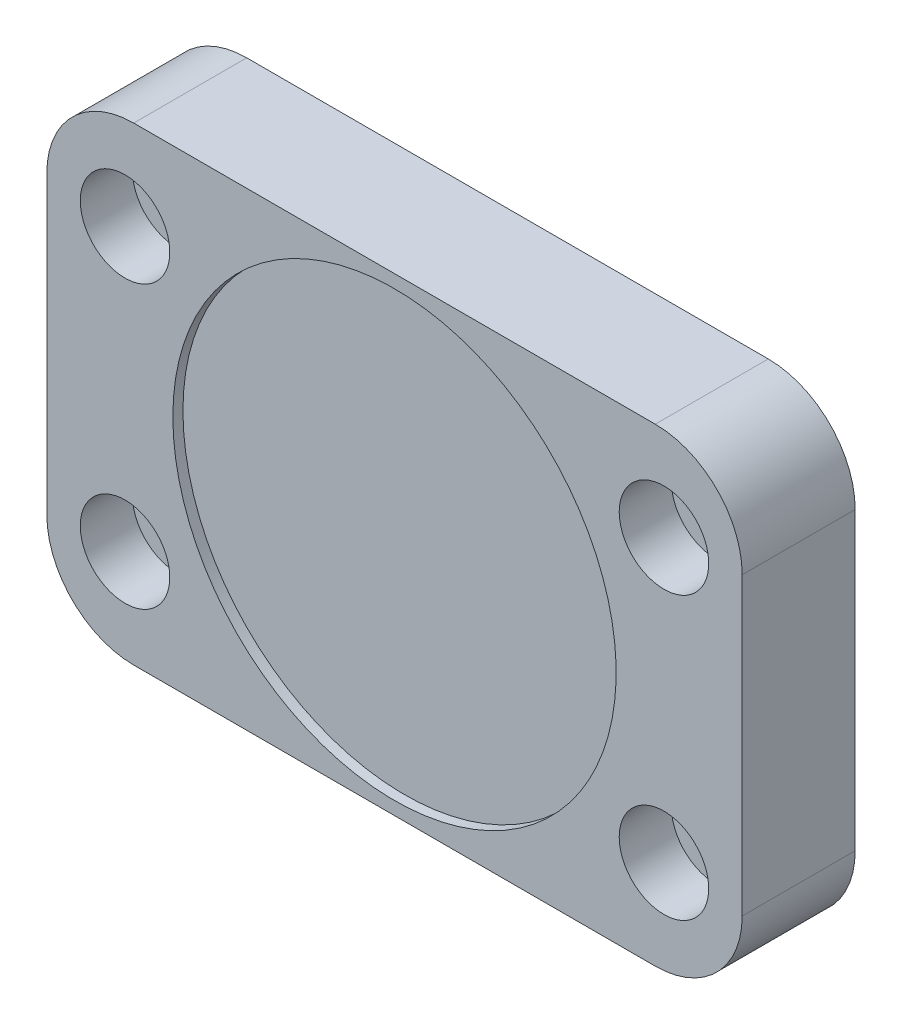
ISO-10303-21;
HEADER;
FILE_DESCRIPTION(('STEP AP214'),'2;1');
FILE_NAME('part.step','',(''),(''),'','','');
FILE_SCHEMA(('AUTOMOTIVE_DESIGN { 1 0 10303 214 1 1 1 1 }'));
ENDSEC;
DATA;
#1=APPLICATION_CONTEXT('core data for automotive mechanical design processes');
#2=APPLICATION_PROTOCOL_DEFINITION('international standard','automotive_design',2000,#1);
#3=PRODUCT_CONTEXT('',#1,'mechanical');
#4=PRODUCT('Part','Part','',(#3));
#5=PRODUCT_RELATED_PRODUCT_CATEGORY('part','',(#4));
#6=PRODUCT_DEFINITION_FORMATION('','',#4);
#7=PRODUCT_DEFINITION_CONTEXT('part definition',#1,'design');
#8=PRODUCT_DEFINITION('design','',#6,#7);
#9=PRODUCT_DEFINITION_SHAPE('','',#8);
#10=(LENGTH_UNIT() NAMED_UNIT(*) SI_UNIT(.MILLI.,.METRE.));
#11=(NAMED_UNIT(*) PLANE_ANGLE_UNIT() SI_UNIT($,.RADIAN.));
#12=(NAMED_UNIT(*) SI_UNIT($,.STERADIAN.) SOLID_ANGLE_UNIT());
#13=UNCERTAINTY_MEASURE_WITH_UNIT(LENGTH_MEASURE(1.E-05),#10,'distance_accuracy_value','');
#14=(GEOMETRIC_REPRESENTATION_CONTEXT(3) GLOBAL_UNCERTAINTY_ASSIGNED_CONTEXT((#13)) GLOBAL_UNIT_ASSIGNED_CONTEXT((#10,
#11,#12)) REPRESENTATION_CONTEXT('',''));
#15=CARTESIAN_POINT('',(0.,0.,0.));
#16=DIRECTION('',(0.,0.,1.));
#17=DIRECTION('',(1.,0.,0.));
#18=AXIS2_PLACEMENT_3D('',#15,#16,#17);
#19=CARTESIAN_POINT('',(0.,189.,37.84));
#20=DIRECTION('',(0.,0.,1.));
#21=DIRECTION('',(1.,0.,0.));
#22=AXIS2_PLACEMENT_3D('',#19,#20,#21);
#23=PLANE('',#22);
#24=CARTESIAN_POINT('',(0.,189.,37.84));
#25=DIRECTION('',(0.,0.,-1.));
#26=DIRECTION('',(-1.,0.,0.));
#27=AXIS2_PLACEMENT_3D('',#24,#25,#26);
#28=CIRCLE('',#27,25.5);
#29=CARTESIAN_POINT('',(-25.5,189.,37.84));
#30=VERTEX_POINT('',#29);
#31=EDGE_CURVE('E19',#30,#30,#28,.F.);
#32=ORIENTED_EDGE('',*,*,#31,.T.);
#33=EDGE_LOOP('',(#32));
#34=FACE_BOUND('',#33,.T.);
#35=ADVANCED_FACE('F16',(#34),#23,.T.);
#36=CARTESIAN_POINT('',(0.,189.,39.));
#37=DIRECTION('',(0.,0.,-1.));
#38=DIRECTION('',(-1.,0.,0.));
#39=AXIS2_PLACEMENT_3D('',#36,#37,#38);
#40=CYLINDRICAL_SURFACE('',#39,25.5);
#41=ORIENTED_EDGE('',*,*,#31,.F.);
#42=EDGE_LOOP('',(#41));
#43=FACE_BOUND('',#42,.T.);
#44=CARTESIAN_POINT('',(0.,189.,39.));
#45=DIRECTION('',(0.,0.,-1.));
#46=DIRECTION('',(-1.,0.,0.));
#47=AXIS2_PLACEMENT_3D('',#44,#45,#46);
#48=CIRCLE('',#47,25.5);
#49=CARTESIAN_POINT('',(-25.5,189.,39.));
#50=VERTEX_POINT('',#49);
#51=EDGE_CURVE('E170',#50,#50,#48,.T.);
#52=ORIENTED_EDGE('',*,*,#51,.F.);
#53=EDGE_LOOP('',(#52));
#54=FACE_BOUND('',#53,.T.);
#55=ADVANCED_FACE('F189',(#43,#54),#40,.F.);
#56=CARTESIAN_POINT('',(30.9999999999999,172.8,36.));
#57=DIRECTION('',(0.,0.,-1.));
#58=DIRECTION('',(-1.,0.,0.));
#59=AXIS2_PLACEMENT_3D('',#56,#57,#58);
#60=CYLINDRICAL_SURFACE('',#59,5.15);
#61=CARTESIAN_POINT('',(30.9999999999999,172.8,33.));
#62=DIRECTION('',(0.,0.,-1.));
#63=DIRECTION('',(-1.,0.,0.));
#64=AXIS2_PLACEMENT_3D('',#61,#62,#63);
#65=CIRCLE('',#64,5.15);
#66=CARTESIAN_POINT('',(25.8499999999999,172.8,33.));
#67=VERTEX_POINT('',#66);
#68=EDGE_CURVE('E167',#67,#67,#65,.T.);
#69=ORIENTED_EDGE('',*,*,#68,.T.);
#70=EDGE_LOOP('',(#69));
#71=FACE_BOUND('',#70,.T.);
#72=CARTESIAN_POINT('',(30.9999999999999,172.8,39.));
#73=DIRECTION('',(0.,0.,-1.));
#74=DIRECTION('',(-1.,0.,0.));
#75=AXIS2_PLACEMENT_3D('',#72,#73,#74);
#76=CIRCLE('',#75,5.15);
#77=CARTESIAN_POINT('',(25.8499999999999,172.8,39.));
#78=VERTEX_POINT('',#77);
#79=EDGE_CURVE('E181',#78,#78,#76,.T.);
#80=ORIENTED_EDGE('',*,*,#79,.F.);
#81=EDGE_LOOP('',(#80));
#82=FACE_BOUND('',#81,.T.);
#83=ADVANCED_FACE('F192',(#71,#82),#60,.F.);
#84=CARTESIAN_POINT('',(-31.0000000000002,205.2,36.));
#85=DIRECTION('',(0.,0.,-1.));
#86=DIRECTION('',(-1.,0.,0.));
#87=AXIS2_PLACEMENT_3D('',#84,#85,#86);
#88=CYLINDRICAL_SURFACE('',#87,5.15);
#89=CARTESIAN_POINT('',(-31.0000000000002,205.2,33.));
#90=DIRECTION('',(0.,0.,-1.));
#91=DIRECTION('',(-1.,0.,0.));
#92=AXIS2_PLACEMENT_3D('',#89,#90,#91);
#93=CIRCLE('',#92,5.15);
#94=CARTESIAN_POINT('',(-36.1500000000002,205.2,33.));
#95=VERTEX_POINT('',#94);
#96=EDGE_CURVE('E164',#95,#95,#93,.T.);
#97=ORIENTED_EDGE('',*,*,#96,.T.);
#98=EDGE_LOOP('',(#97));
#99=FACE_BOUND('',#98,.T.);
#100=CARTESIAN_POINT('',(-31.0000000000002,205.2,39.));
#101=DIRECTION('',(0.,0.,-1.));
#102=DIRECTION('',(-1.,0.,0.));
#103=AXIS2_PLACEMENT_3D('',#100,#101,#102);
#104=CIRCLE('',#103,5.15);
#105=CARTESIAN_POINT('',(-36.1500000000002,205.2,39.));
#106=VERTEX_POINT('',#105);
#107=EDGE_CURVE('E179',#106,#106,#104,.T.);
#108=ORIENTED_EDGE('',*,*,#107,.F.);
#109=EDGE_LOOP('',(#108));
#110=FACE_BOUND('',#109,.T.);
#111=ADVANCED_FACE('F206',(#99,#110),#88,.F.);
#112=CARTESIAN_POINT('',(-31.0000000000001,172.8,36.));
#113=DIRECTION('',(0.,0.,-1.));
#114=DIRECTION('',(-1.,0.,0.));
#115=AXIS2_PLACEMENT_3D('',#112,#113,#114);
#116=CYLINDRICAL_SURFACE('',#115,5.15);
#117=CARTESIAN_POINT('',(-31.0000000000001,172.8,33.));
#118=DIRECTION('',(0.,0.,-1.));
#119=DIRECTION('',(-1.,0.,0.));
#120=AXIS2_PLACEMENT_3D('',#117,#118,#119);
#121=CIRCLE('',#120,5.15);
#122=CARTESIAN_POINT('',(-36.1500000000001,172.8,33.));
#123=VERTEX_POINT('',#122);
#124=EDGE_CURVE('E161',#123,#123,#121,.T.);
#125=ORIENTED_EDGE('',*,*,#124,.T.);
#126=EDGE_LOOP('',(#125));
#127=FACE_BOUND('',#126,.T.);
#128=CARTESIAN_POINT('',(-31.0000000000001,172.8,39.));
#129=DIRECTION('',(0.,0.,-1.));
#130=DIRECTION('',(-1.,0.,0.));
#131=AXIS2_PLACEMENT_3D('',#128,#129,#130);
#132=CIRCLE('',#131,5.15);
#133=CARTESIAN_POINT('',(-36.1500000000001,172.8,39.));
#134=VERTEX_POINT('',#133);
#135=EDGE_CURVE('E176',#134,#134,#132,.T.);
#136=ORIENTED_EDGE('',*,*,#135,.F.);
#137=EDGE_LOOP('',(#136));
#138=FACE_BOUND('',#137,.T.);
#139=ADVANCED_FACE('F208',(#127,#138),#116,.F.);
#140=CARTESIAN_POINT('',(30.9999999999998,205.2,36.));
#141=DIRECTION('',(0.,0.,-1.));
#142=DIRECTION('',(-1.,0.,0.));
#143=AXIS2_PLACEMENT_3D('',#140,#141,#142);
#144=CYLINDRICAL_SURFACE('',#143,5.15);
#145=CARTESIAN_POINT('',(30.9999999999998,205.2,33.));
#146=DIRECTION('',(0.,0.,-1.));
#147=DIRECTION('',(-1.,0.,0.));
#148=AXIS2_PLACEMENT_3D('',#145,#146,#147);
#149=CIRCLE('',#148,5.15);
#150=CARTESIAN_POINT('',(25.8499999999998,205.2,33.));
#151=VERTEX_POINT('',#150);
#152=EDGE_CURVE('E102',#151,#151,#149,.T.);
#153=ORIENTED_EDGE('',*,*,#152,.T.);
#154=EDGE_LOOP('',(#153));
#155=FACE_BOUND('',#154,.T.);
#156=CARTESIAN_POINT('',(30.9999999999998,205.2,39.));
#157=DIRECTION('',(0.,0.,-1.));
#158=DIRECTION('',(-1.,0.,0.));
#159=AXIS2_PLACEMENT_3D('',#156,#157,#158);
#160=CIRCLE('',#159,5.15);
#161=CARTESIAN_POINT('',(25.8499999999998,205.2,39.));
#162=VERTEX_POINT('',#161);
#163=EDGE_CURVE('E173',#162,#162,#160,.T.);
#164=ORIENTED_EDGE('',*,*,#163,.F.);
#165=EDGE_LOOP('',(#164));
#166=FACE_BOUND('',#165,.T.);
#167=ADVANCED_FACE('F198',(#155,#166),#144,.F.);
#168=CARTESIAN_POINT('',(0.,189.,39.));
#169=DIRECTION('',(0.,0.,1.));
#170=DIRECTION('',(1.,0.,0.));
#171=AXIS2_PLACEMENT_3D('',#168,#169,#170);
#172=PLANE('',#171);
#173=ORIENTED_EDGE('',*,*,#51,.T.);
#174=EDGE_LOOP('',(#173));
#175=FACE_BOUND('',#174,.T.);
#176=ORIENTED_EDGE('',*,*,#163,.T.);
#177=EDGE_LOOP('',(#176));
#178=FACE_BOUND('',#177,.T.);
#179=ORIENTED_EDGE('',*,*,#135,.T.);
#180=EDGE_LOOP('',(#179));
#181=FACE_BOUND('',#180,.T.);
#182=ORIENTED_EDGE('',*,*,#107,.T.);
#183=EDGE_LOOP('',(#182));
#184=FACE_BOUND('',#183,.T.);
#185=ORIENTED_EDGE('',*,*,#79,.T.);
#186=EDGE_LOOP('',(#185));
#187=FACE_BOUND('',#186,.T.);
#188=CARTESIAN_POINT('',(30.0000000000002,206.,39.));
#189=DIRECTION('',(0.,0.,1.));
#190=DIRECTION('',(1.,0.,0.));
#191=AXIS2_PLACEMENT_3D('',#188,#189,#190);
#192=CIRCLE('',#191,10.);
#193=CARTESIAN_POINT('',(30.0000000000002,216.,39.));
#194=VERTEX_POINT('',#193);
#195=CARTESIAN_POINT('',(40.0000000000002,206.,39.));
#196=VERTEX_POINT('',#195);
#197=EDGE_CURVE('E155',#194,#196,#192,.F.);
#198=ORIENTED_EDGE('',*,*,#197,.F.);
#199=DIRECTION('',(1.,0.,0.));
#200=VECTOR('',#199,1.);
#201=CARTESIAN_POINT('',(30.0000000000002,216.,39.));
#202=LINE('',#201,#200);
#203=CARTESIAN_POINT('',(-30.0000000000002,216.,39.));
#204=VERTEX_POINT('',#203);
#205=EDGE_CURVE('E112',#204,#194,#202,.T.);
#206=ORIENTED_EDGE('',*,*,#205,.F.);
#207=CARTESIAN_POINT('',(-30.0000000000002,206.,39.));
#208=DIRECTION('',(0.,0.,1.));
#209=DIRECTION('',(1.,0.,0.));
#210=AXIS2_PLACEMENT_3D('',#207,#208,#209);
#211=CIRCLE('',#210,10.);
#212=CARTESIAN_POINT('',(-40.0000000000002,206.,39.));
#213=VERTEX_POINT('',#212);
#214=EDGE_CURVE('E98',#213,#204,#211,.F.);
#215=ORIENTED_EDGE('',*,*,#214,.F.);
#216=DIRECTION('',(0.,1.,0.));
#217=VECTOR('',#216,1.);
#218=CARTESIAN_POINT('',(-40.0000000000002,206.,39.));
#219=LINE('',#218,#217);
#220=CARTESIAN_POINT('',(-40.0000000000002,172.,39.));
#221=VERTEX_POINT('',#220);
#222=EDGE_CURVE('E92',#221,#213,#219,.T.);
#223=ORIENTED_EDGE('',*,*,#222,.F.);
#224=CARTESIAN_POINT('',(-30.0000000000002,172.,39.));
#225=DIRECTION('',(0.,0.,1.));
#226=DIRECTION('',(1.,0.,0.));
#227=AXIS2_PLACEMENT_3D('',#224,#225,#226);
#228=CIRCLE('',#227,10.);
#229=CARTESIAN_POINT('',(-30.0000000000002,162.,39.));
#230=VERTEX_POINT('',#229);
#231=EDGE_CURVE('E83',#230,#221,#228,.F.);
#232=ORIENTED_EDGE('',*,*,#231,.F.);
#233=DIRECTION('',(1.,0.,0.));
#234=VECTOR('',#233,1.);
#235=CARTESIAN_POINT('',(-30.0000000000002,162.,39.));
#236=LINE('',#235,#234);
#237=CARTESIAN_POINT('',(30.0000000000002,162.,39.));
#238=VERTEX_POINT('',#237);
#239=EDGE_CURVE('E78',#238,#230,#236,.F.);
#240=ORIENTED_EDGE('',*,*,#239,.F.);
#241=CARTESIAN_POINT('',(30.0000000000002,172.,39.));
#242=DIRECTION('',(0.,0.,1.));
#243=DIRECTION('',(1.,0.,0.));
#244=AXIS2_PLACEMENT_3D('',#241,#242,#243);
#245=CIRCLE('',#244,10.);
#246=CARTESIAN_POINT('',(40.0000000000002,172.,39.));
#247=VERTEX_POINT('',#246);
#248=EDGE_CURVE('E157',#247,#238,#245,.F.);
#249=ORIENTED_EDGE('',*,*,#248,.F.);
#250=DIRECTION('',(0.,1.,0.));
#251=VECTOR('',#250,1.);
#252=CARTESIAN_POINT('',(40.0000000000002,172.,39.));
#253=LINE('',#252,#251);
#254=EDGE_CURVE('E116',#196,#247,#253,.F.);
#255=ORIENTED_EDGE('',*,*,#254,.F.);
#256=EDGE_LOOP('',(#198,#206,#215,#223,#232,#240,#249,#255));
#257=FACE_BOUND('',#256,.T.);
#258=ADVANCED_FACE('F96',(#175,#178,#181,#184,#187,#257),#172,.T.);
#259=CARTESIAN_POINT('',(30.9999999999999,172.8,33.));
#260=DIRECTION('',(0.,0.,-1.));
#261=DIRECTION('',(-1.,0.,0.));
#262=AXIS2_PLACEMENT_3D('',#259,#260,#261);
#263=PLANE('',#262);
#264=CARTESIAN_POINT('',(30.9999999999999,172.8,33.));
#265=DIRECTION('',(0.,0.,-1.));
#266=DIRECTION('',(-1.,0.,0.));
#267=AXIS2_PLACEMENT_3D('',#264,#265,#266);
#268=CIRCLE('',#267,3.075);
#269=CARTESIAN_POINT('',(27.9249999999999,172.8,33.));
#270=VERTEX_POINT('',#269);
#271=EDGE_CURVE('E150',#270,#270,#268,.T.);
#272=ORIENTED_EDGE('',*,*,#271,.T.);
#273=EDGE_LOOP('',(#272));
#274=FACE_BOUND('',#273,.T.);
#275=ORIENTED_EDGE('',*,*,#68,.F.);
#276=EDGE_LOOP('',(#275));
#277=FACE_BOUND('',#276,.T.);
#278=ADVANCED_FACE('F197',(#274,#277),#263,.F.);
#279=CARTESIAN_POINT('',(-31.0000000000002,205.2,33.));
#280=DIRECTION('',(0.,0.,-1.));
#281=DIRECTION('',(-1.,0.,0.));
#282=AXIS2_PLACEMENT_3D('',#279,#280,#281);
#283=PLANE('',#282);
#284=CARTESIAN_POINT('',(-31.0000000000002,205.2,33.));
#285=DIRECTION('',(0.,0.,-1.));
#286=DIRECTION('',(-1.,0.,0.));
#287=AXIS2_PLACEMENT_3D('',#284,#285,#286);
#288=CIRCLE('',#287,3.075);
#289=CARTESIAN_POINT('',(-34.0750000000002,205.2,33.));
#290=VERTEX_POINT('',#289);
#291=EDGE_CURVE('E147',#290,#290,#288,.T.);
#292=ORIENTED_EDGE('',*,*,#291,.T.);
#293=EDGE_LOOP('',(#292));
#294=FACE_BOUND('',#293,.T.);
#295=ORIENTED_EDGE('',*,*,#96,.F.);
#296=EDGE_LOOP('',(#295));
#297=FACE_BOUND('',#296,.T.);
#298=ADVANCED_FACE('F278',(#294,#297),#283,.F.);
#299=CARTESIAN_POINT('',(-31.0000000000001,172.8,33.));
#300=DIRECTION('',(0.,0.,-1.));
#301=DIRECTION('',(-1.,0.,0.));
#302=AXIS2_PLACEMENT_3D('',#299,#300,#301);
#303=PLANE('',#302);
#304=CARTESIAN_POINT('',(-31.0000000000001,172.8,33.));
#305=DIRECTION('',(0.,0.,-1.));
#306=DIRECTION('',(-1.,0.,0.));
#307=AXIS2_PLACEMENT_3D('',#304,#305,#306);
#308=CIRCLE('',#307,3.075);
#309=CARTESIAN_POINT('',(-34.0750000000001,172.8,33.));
#310=VERTEX_POINT('',#309);
#311=EDGE_CURVE('E144',#310,#310,#308,.T.);
#312=ORIENTED_EDGE('',*,*,#311,.T.);
#313=EDGE_LOOP('',(#312));
#314=FACE_BOUND('',#313,.T.);
#315=ORIENTED_EDGE('',*,*,#124,.F.);
#316=EDGE_LOOP('',(#315));
#317=FACE_BOUND('',#316,.T.);
#318=ADVANCED_FACE('F274',(#314,#317),#303,.F.);
#319=CARTESIAN_POINT('',(30.9999999999998,205.2,33.));
#320=DIRECTION('',(0.,0.,-1.));
#321=DIRECTION('',(-1.,0.,0.));
#322=AXIS2_PLACEMENT_3D('',#319,#320,#321);
#323=PLANE('',#322);
#324=CARTESIAN_POINT('',(30.9999999999998,205.2,33.));
#325=DIRECTION('',(0.,0.,-1.));
#326=DIRECTION('',(-1.,0.,0.));
#327=AXIS2_PLACEMENT_3D('',#324,#325,#326);
#328=CIRCLE('',#327,3.075);
#329=CARTESIAN_POINT('',(27.9249999999998,205.2,33.));
#330=VERTEX_POINT('',#329);
#331=EDGE_CURVE('E141',#330,#330,#328,.T.);
#332=ORIENTED_EDGE('',*,*,#331,.T.);
#333=EDGE_LOOP('',(#332));
#334=FACE_BOUND('',#333,.T.);
#335=ORIENTED_EDGE('',*,*,#152,.F.);
#336=EDGE_LOOP('',(#335));
#337=FACE_BOUND('',#336,.T.);
#338=ADVANCED_FACE('F271',(#334,#337),#323,.F.);
#339=CARTESIAN_POINT('',(-40.0000000000002,206.,26.));
#340=DIRECTION('',(-1.,0.,0.));
#341=DIRECTION('',(0.,0.,1.));
#342=AXIS2_PLACEMENT_3D('',#339,#340,#341);
#343=PLANE('',#342);
#344=ORIENTED_EDGE('',*,*,#222,.T.);
#345=DIRECTION('',(0.,0.,1.));
#346=VECTOR('',#345,1.);
#347=CARTESIAN_POINT('',(-40.0000000000002,206.,26.));
#348=LINE('',#347,#346);
#349=CARTESIAN_POINT('',(-40.0000000000002,206.,26.));
#350=VERTEX_POINT('',#349);
#351=EDGE_CURVE('E154',#350,#213,#348,.T.);
#352=ORIENTED_EDGE('',*,*,#351,.F.);
#353=DIRECTION('',(0.,1.,0.));
#354=VECTOR('',#353,1.);
#355=CARTESIAN_POINT('',(-40.0000000000002,189.,26.));
#356=LINE('',#355,#354);
#357=CARTESIAN_POINT('',(-40.0000000000002,172.,26.));
#358=VERTEX_POINT('',#357);
#359=EDGE_CURVE('E106',#350,#358,#356,.F.);
#360=ORIENTED_EDGE('',*,*,#359,.T.);
#361=DIRECTION('',(0.,0.,1.));
#362=VECTOR('',#361,1.);
#363=CARTESIAN_POINT('',(-40.0000000000002,172.,26.));
#364=LINE('',#363,#362);
#365=EDGE_CURVE('E88',#221,#358,#364,.F.);
#366=ORIENTED_EDGE('',*,*,#365,.F.);
#367=EDGE_LOOP('',(#344,#352,#360,#366));
#368=FACE_BOUND('',#367,.T.);
#369=ADVANCED_FACE('F105',(#368),#343,.T.);
#370=CARTESIAN_POINT('',(-30.0000000000002,172.,26.));
#371=DIRECTION('',(0.,0.,1.));
#372=DIRECTION('',(1.,0.,0.));
#373=AXIS2_PLACEMENT_3D('',#370,#371,#372);
#374=CYLINDRICAL_SURFACE('',#373,10.);
#375=ORIENTED_EDGE('',*,*,#231,.T.);
#376=ORIENTED_EDGE('',*,*,#365,.T.);
#377=CARTESIAN_POINT('',(-30.0000000000002,172.,26.));
#378=DIRECTION('',(0.,0.,1.));
#379=DIRECTION('',(1.,0.,0.));
#380=AXIS2_PLACEMENT_3D('',#377,#378,#379);
#381=CIRCLE('',#380,10.);
#382=CARTESIAN_POINT('',(-30.0000000000002,162.,26.));
#383=VERTEX_POINT('',#382);
#384=EDGE_CURVE('E139',#358,#383,#381,.T.);
#385=ORIENTED_EDGE('',*,*,#384,.T.);
#386=DIRECTION('',(0.,0.,-1.));
#387=VECTOR('',#386,1.);
#388=CARTESIAN_POINT('',(-30.0000000000002,162.,26.));
#389=LINE('',#388,#387);
#390=EDGE_CURVE('E90',#230,#383,#389,.T.);
#391=ORIENTED_EDGE('',*,*,#390,.F.);
#392=EDGE_LOOP('',(#375,#376,#385,#391));
#393=FACE_BOUND('',#392,.T.);
#394=ADVANCED_FACE('F85',(#393),#374,.T.);
#395=CARTESIAN_POINT('',(-30.0000000000002,162.,26.));
#396=DIRECTION('',(0.,-1.,0.));
#397=DIRECTION('',(0.,0.,-1.));
#398=AXIS2_PLACEMENT_3D('',#395,#396,#397);
#399=PLANE('',#398);
#400=ORIENTED_EDGE('',*,*,#239,.T.);
#401=ORIENTED_EDGE('',*,*,#390,.T.);
#402=DIRECTION('',(1.,0.,0.));
#403=VECTOR('',#402,1.);
#404=CARTESIAN_POINT('',(0.,162.,26.));
#405=LINE('',#404,#403);
#406=CARTESIAN_POINT('',(30.0000000000002,162.,26.));
#407=VERTEX_POINT('',#406);
#408=EDGE_CURVE('E138',#383,#407,#405,.T.);
#409=ORIENTED_EDGE('',*,*,#408,.T.);
#410=DIRECTION('',(0.,0.,1.));
#411=VECTOR('',#410,1.);
#412=CARTESIAN_POINT('',(30.0000000000002,162.,26.));
#413=LINE('',#412,#411);
#414=EDGE_CURVE('E118',#238,#407,#413,.F.);
#415=ORIENTED_EDGE('',*,*,#414,.F.);
#416=EDGE_LOOP('',(#400,#401,#409,#415));
#417=FACE_BOUND('',#416,.T.);
#418=ADVANCED_FACE('F263',(#417),#399,.T.);
#419=CARTESIAN_POINT('',(30.0000000000002,172.,26.));
#420=DIRECTION('',(0.,0.,1.));
#421=DIRECTION('',(1.,0.,0.));
#422=AXIS2_PLACEMENT_3D('',#419,#420,#421);
#423=CYLINDRICAL_SURFACE('',#422,10.);
#424=ORIENTED_EDGE('',*,*,#248,.T.);
#425=ORIENTED_EDGE('',*,*,#414,.T.);
#426=CARTESIAN_POINT('',(30.0000000000002,172.,26.));
#427=DIRECTION('',(0.,0.,1.));
#428=DIRECTION('',(1.,0.,0.));
#429=AXIS2_PLACEMENT_3D('',#426,#427,#428);
#430=CIRCLE('',#429,10.);
#431=CARTESIAN_POINT('',(40.0000000000002,172.,26.));
#432=VERTEX_POINT('',#431);
#433=EDGE_CURVE('E135',#407,#432,#430,.T.);
#434=ORIENTED_EDGE('',*,*,#433,.T.);
#435=DIRECTION('',(0.,0.,-1.));
#436=VECTOR('',#435,1.);
#437=CARTESIAN_POINT('',(40.0000000000002,172.,26.));
#438=LINE('',#437,#436);
#439=EDGE_CURVE('E117',#247,#432,#438,.T.);
#440=ORIENTED_EDGE('',*,*,#439,.F.);
#441=EDGE_LOOP('',(#424,#425,#434,#440));
#442=FACE_BOUND('',#441,.T.);
#443=ADVANCED_FACE('F259',(#442),#423,.T.);
#444=CARTESIAN_POINT('',(40.0000000000002,172.,26.));
#445=DIRECTION('',(1.,0.,0.));
#446=DIRECTION('',(0.,0.,-1.));
#447=AXIS2_PLACEMENT_3D('',#444,#445,#446);
#448=PLANE('',#447);
#449=ORIENTED_EDGE('',*,*,#254,.T.);
#450=ORIENTED_EDGE('',*,*,#439,.T.);
#451=DIRECTION('',(0.,1.,0.));
#452=VECTOR('',#451,1.);
#453=CARTESIAN_POINT('',(40.0000000000002,189.,26.));
#454=LINE('',#453,#452);
#455=CARTESIAN_POINT('',(40.0000000000002,206.,26.));
#456=VERTEX_POINT('',#455);
#457=EDGE_CURVE('E134',#432,#456,#454,.T.);
#458=ORIENTED_EDGE('',*,*,#457,.T.);
#459=DIRECTION('',(0.,0.,1.));
#460=VECTOR('',#459,1.);
#461=CARTESIAN_POINT('',(40.0000000000002,206.,26.));
#462=LINE('',#461,#460);
#463=EDGE_CURVE('E114',#196,#456,#462,.F.);
#464=ORIENTED_EDGE('',*,*,#463,.F.);
#465=EDGE_LOOP('',(#449,#450,#458,#464));
#466=FACE_BOUND('',#465,.T.);
#467=ADVANCED_FACE('F255',(#466),#448,.T.);
#468=CARTESIAN_POINT('',(30.0000000000002,206.,26.));
#469=DIRECTION('',(0.,0.,1.));
#470=DIRECTION('',(1.,0.,0.));
#471=AXIS2_PLACEMENT_3D('',#468,#469,#470);
#472=CYLINDRICAL_SURFACE('',#471,10.);
#473=ORIENTED_EDGE('',*,*,#197,.T.);
#474=ORIENTED_EDGE('',*,*,#463,.T.);
#475=CARTESIAN_POINT('',(30.0000000000002,206.,26.));
#476=DIRECTION('',(0.,0.,1.));
#477=DIRECTION('',(1.,0.,0.));
#478=AXIS2_PLACEMENT_3D('',#475,#476,#477);
#479=CIRCLE('',#478,10.);
#480=CARTESIAN_POINT('',(30.0000000000002,216.,26.));
#481=VERTEX_POINT('',#480);
#482=EDGE_CURVE('E131',#456,#481,#479,.T.);
#483=ORIENTED_EDGE('',*,*,#482,.T.);
#484=DIRECTION('',(0.,0.,1.));
#485=VECTOR('',#484,1.);
#486=CARTESIAN_POINT('',(30.0000000000002,216.,26.));
#487=LINE('',#486,#485);
#488=EDGE_CURVE('E113',#194,#481,#487,.F.);
#489=ORIENTED_EDGE('',*,*,#488,.F.);
#490=EDGE_LOOP('',(#473,#474,#483,#489));
#491=FACE_BOUND('',#490,.T.);
#492=ADVANCED_FACE('F251',(#491),#472,.T.);
#493=CARTESIAN_POINT('',(30.0000000000002,216.,26.));
#494=DIRECTION('',(0.,1.,0.));
#495=DIRECTION('',(0.,0.,1.));
#496=AXIS2_PLACEMENT_3D('',#493,#494,#495);
#497=PLANE('',#496);
#498=ORIENTED_EDGE('',*,*,#205,.T.);
#499=ORIENTED_EDGE('',*,*,#488,.T.);
#500=DIRECTION('',(1.,0.,0.));
#501=VECTOR('',#500,1.);
#502=CARTESIAN_POINT('',(0.,216.,26.));
#503=LINE('',#502,#501);
#504=CARTESIAN_POINT('',(-30.0000000000002,216.,26.));
#505=VERTEX_POINT('',#504);
#506=EDGE_CURVE('E130',#481,#505,#503,.F.);
#507=ORIENTED_EDGE('',*,*,#506,.T.);
#508=DIRECTION('',(0.,0.,1.));
#509=VECTOR('',#508,1.);
#510=CARTESIAN_POINT('',(-30.0000000000002,216.,26.));
#511=LINE('',#510,#509);
#512=EDGE_CURVE('E34',#204,#505,#511,.F.);
#513=ORIENTED_EDGE('',*,*,#512,.F.);
#514=EDGE_LOOP('',(#498,#499,#507,#513));
#515=FACE_BOUND('',#514,.T.);
#516=ADVANCED_FACE('F248',(#515),#497,.T.);
#517=CARTESIAN_POINT('',(-30.0000000000002,206.,26.));
#518=DIRECTION('',(0.,0.,1.));
#519=DIRECTION('',(1.,0.,0.));
#520=AXIS2_PLACEMENT_3D('',#517,#518,#519);
#521=CYLINDRICAL_SURFACE('',#520,10.);
#522=ORIENTED_EDGE('',*,*,#214,.T.);
#523=ORIENTED_EDGE('',*,*,#512,.T.);
#524=CARTESIAN_POINT('',(-30.0000000000002,206.,26.));
#525=DIRECTION('',(0.,0.,1.));
#526=DIRECTION('',(1.,0.,0.));
#527=AXIS2_PLACEMENT_3D('',#524,#525,#526);
#528=CIRCLE('',#527,10.);
#529=EDGE_CURVE('E128',#505,#350,#528,.T.);
#530=ORIENTED_EDGE('',*,*,#529,.T.);
#531=ORIENTED_EDGE('',*,*,#351,.T.);
#532=EDGE_LOOP('',(#522,#523,#530,#531));
#533=FACE_BOUND('',#532,.T.);
#534=ADVANCED_FACE('F244',(#533),#521,.T.);
#535=CARTESIAN_POINT('',(30.9999999999999,172.8,17.55));
#536=DIRECTION('',(0.,0.,-1.));
#537=DIRECTION('',(-1.,0.,0.));
#538=AXIS2_PLACEMENT_3D('',#535,#536,#537);
#539=CYLINDRICAL_SURFACE('',#538,3.075);
#540=CARTESIAN_POINT('',(30.9999999999999,172.8,26.));
#541=DIRECTION('',(0.,0.,-1.));
#542=DIRECTION('',(-1.,0.,0.));
#543=AXIS2_PLACEMENT_3D('',#540,#541,#542);
#544=CIRCLE('',#543,3.075);
#545=CARTESIAN_POINT('',(27.9249999999999,172.8,26.));
#546=VERTEX_POINT('',#545);
#547=EDGE_CURVE('E125',#546,#546,#544,.T.);
#548=ORIENTED_EDGE('',*,*,#547,.T.);
#549=EDGE_LOOP('',(#548));
#550=FACE_BOUND('',#549,.T.);
#551=ORIENTED_EDGE('',*,*,#271,.F.);
#552=EDGE_LOOP('',(#551));
#553=FACE_BOUND('',#552,.T.);
#554=ADVANCED_FACE('F240',(#550,#553),#539,.F.);
#555=CARTESIAN_POINT('',(-31.0000000000002,205.2,17.55));
#556=DIRECTION('',(0.,0.,-1.));
#557=DIRECTION('',(-1.,0.,0.));
#558=AXIS2_PLACEMENT_3D('',#555,#556,#557);
#559=CYLINDRICAL_SURFACE('',#558,3.075);
#560=CARTESIAN_POINT('',(-31.0000000000002,205.2,26.));
#561=DIRECTION('',(0.,0.,-1.));
#562=DIRECTION('',(-1.,0.,0.));
#563=AXIS2_PLACEMENT_3D('',#560,#561,#562);
#564=CIRCLE('',#563,3.075);
#565=CARTESIAN_POINT('',(-34.0750000000002,205.2,26.));
#566=VERTEX_POINT('',#565);
#567=EDGE_CURVE('E122',#566,#566,#564,.T.);
#568=ORIENTED_EDGE('',*,*,#567,.T.);
#569=EDGE_LOOP('',(#568));
#570=FACE_BOUND('',#569,.T.);
#571=ORIENTED_EDGE('',*,*,#291,.F.);
#572=EDGE_LOOP('',(#571));
#573=FACE_BOUND('',#572,.T.);
#574=ADVANCED_FACE('F236',(#570,#573),#559,.F.);
#575=CARTESIAN_POINT('',(-31.0000000000001,172.8,17.55));
#576=DIRECTION('',(0.,0.,-1.));
#577=DIRECTION('',(-1.,0.,0.));
#578=AXIS2_PLACEMENT_3D('',#575,#576,#577);
#579=CYLINDRICAL_SURFACE('',#578,3.075);
#580=CARTESIAN_POINT('',(-31.0000000000001,172.8,26.));
#581=DIRECTION('',(0.,0.,-1.));
#582=DIRECTION('',(-1.,0.,0.));
#583=AXIS2_PLACEMENT_3D('',#580,#581,#582);
#584=CIRCLE('',#583,3.075);
#585=CARTESIAN_POINT('',(-34.0750000000001,172.8,26.));
#586=VERTEX_POINT('',#585);
#587=EDGE_CURVE('E25',#586,#586,#584,.T.);
#588=ORIENTED_EDGE('',*,*,#587,.T.);
#589=EDGE_LOOP('',(#588));
#590=FACE_BOUND('',#589,.T.);
#591=ORIENTED_EDGE('',*,*,#311,.F.);
#592=EDGE_LOOP('',(#591));
#593=FACE_BOUND('',#592,.T.);
#594=ADVANCED_FACE('F228',(#590,#593),#579,.F.);
#595=CARTESIAN_POINT('',(30.9999999999998,205.2,17.55));
#596=DIRECTION('',(0.,0.,-1.));
#597=DIRECTION('',(-1.,0.,0.));
#598=AXIS2_PLACEMENT_3D('',#595,#596,#597);
#599=CYLINDRICAL_SURFACE('',#598,3.075);
#600=CARTESIAN_POINT('',(30.9999999999998,205.2,26.));
#601=DIRECTION('',(0.,0.,-1.));
#602=DIRECTION('',(-1.,0.,0.));
#603=AXIS2_PLACEMENT_3D('',#600,#601,#602);
#604=CIRCLE('',#603,3.075);
#605=CARTESIAN_POINT('',(27.9249999999998,205.2,26.));
#606=VERTEX_POINT('',#605);
#607=EDGE_CURVE('E11',#606,#606,#604,.T.);
#608=ORIENTED_EDGE('',*,*,#607,.T.);
#609=EDGE_LOOP('',(#608));
#610=FACE_BOUND('',#609,.T.);
#611=ORIENTED_EDGE('',*,*,#331,.F.);
#612=EDGE_LOOP('',(#611));
#613=FACE_BOUND('',#612,.T.);
#614=ADVANCED_FACE('F222',(#610,#613),#599,.F.);
#615=CARTESIAN_POINT('',(0.,189.,26.));
#616=DIRECTION('',(0.,0.,1.));
#617=DIRECTION('',(1.,0.,0.));
#618=AXIS2_PLACEMENT_3D('',#615,#616,#617);
#619=PLANE('',#618);
#620=ORIENTED_EDGE('',*,*,#607,.F.);
#621=EDGE_LOOP('',(#620));
#622=FACE_BOUND('',#621,.T.);
#623=ORIENTED_EDGE('',*,*,#587,.F.);
#624=EDGE_LOOP('',(#623));
#625=FACE_BOUND('',#624,.T.);
#626=ORIENTED_EDGE('',*,*,#567,.F.);
#627=EDGE_LOOP('',(#626));
#628=FACE_BOUND('',#627,.T.);
#629=ORIENTED_EDGE('',*,*,#547,.F.);
#630=EDGE_LOOP('',(#629));
#631=FACE_BOUND('',#630,.T.);
#632=ORIENTED_EDGE('',*,*,#506,.F.);
#633=ORIENTED_EDGE('',*,*,#482,.F.);
#634=ORIENTED_EDGE('',*,*,#457,.F.);
#635=ORIENTED_EDGE('',*,*,#433,.F.);
#636=ORIENTED_EDGE('',*,*,#408,.F.);
#637=ORIENTED_EDGE('',*,*,#384,.F.);
#638=ORIENTED_EDGE('',*,*,#359,.F.);
#639=ORIENTED_EDGE('',*,*,#529,.F.);
#640=EDGE_LOOP('',(#632,#633,#634,#635,#636,#637,#638,#639));
#641=FACE_BOUND('',#640,.T.);
#642=ADVANCED_FACE('F220',(#622,#625,#628,#631,#641),#619,.F.);
#643=CLOSED_SHELL('',(#35,#55,#83,#111,#139,#167,#258,#278,#298,#318,#338,#369,#394,#418,#443,
#467,#492,#516,#534,#554,#574,#594,#614,#642));
#644=MANIFOLD_SOLID_BREP('B1',#643);
#645=ADVANCED_BREP_SHAPE_REPRESENTATION('',(#18,#644),#14);
#646=SHAPE_DEFINITION_REPRESENTATION(#9,#645);
ENDSEC;
END-ISO-10303-21;
